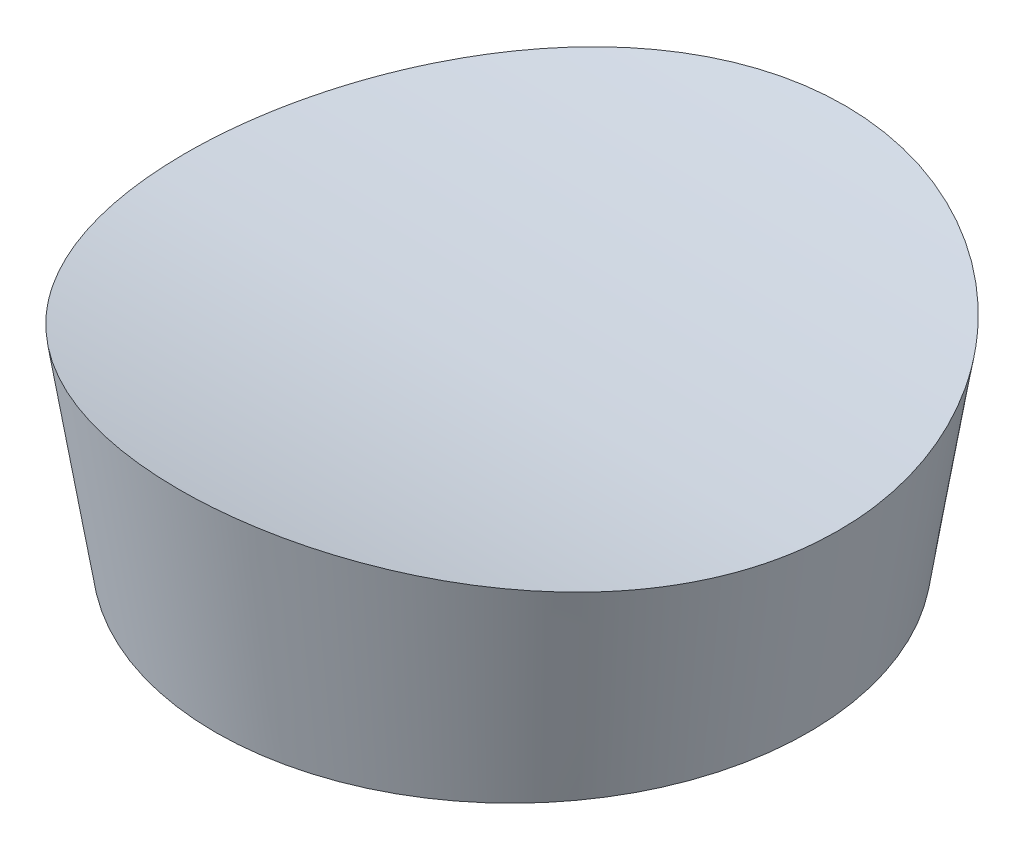
ISO-10303-21;
HEADER;
FILE_DESCRIPTION(('STEP AP214'),'2;1');
FILE_NAME('part.step','',(''),(''),'','','');
FILE_SCHEMA(('AUTOMOTIVE_DESIGN { 1 0 10303 214 1 1 1 1 }'));
ENDSEC;
DATA;
#1=APPLICATION_CONTEXT('core data for automotive mechanical design processes');
#2=APPLICATION_PROTOCOL_DEFINITION('international standard','automotive_design',2000,#1);
#3=PRODUCT_CONTEXT('',#1,'mechanical');
#4=PRODUCT('Part','Part','',(#3));
#5=PRODUCT_RELATED_PRODUCT_CATEGORY('part','',(#4));
#6=PRODUCT_DEFINITION_FORMATION('','',#4);
#7=PRODUCT_DEFINITION_CONTEXT('part definition',#1,'design');
#8=PRODUCT_DEFINITION('design','',#6,#7);
#9=PRODUCT_DEFINITION_SHAPE('','',#8);
#10=(LENGTH_UNIT() NAMED_UNIT(*) SI_UNIT(.MILLI.,.METRE.));
#11=(NAMED_UNIT(*) PLANE_ANGLE_UNIT() SI_UNIT($,.RADIAN.));
#12=(NAMED_UNIT(*) SI_UNIT($,.STERADIAN.) SOLID_ANGLE_UNIT());
#13=UNCERTAINTY_MEASURE_WITH_UNIT(LENGTH_MEASURE(1.E-05),#10,'distance_accuracy_value','');
#14=(GEOMETRIC_REPRESENTATION_CONTEXT(3) GLOBAL_UNCERTAINTY_ASSIGNED_CONTEXT((#13)) GLOBAL_UNIT_ASSIGNED_CONTEXT((#10,
#11,#12)) REPRESENTATION_CONTEXT('',''));
#15=CARTESIAN_POINT('',(0.,0.,0.));
#16=DIRECTION('',(0.,0.,1.));
#17=DIRECTION('',(1.,0.,0.));
#18=AXIS2_PLACEMENT_3D('',#15,#16,#17);
#19=CARTESIAN_POINT('',(0.,0.,0.));
#20=DIRECTION('',(0.,1.,0.));
#21=DIRECTION('',(0.,0.,1.));
#22=AXIS2_PLACEMENT_3D('',#19,#20,#21);
#23=CONICAL_SURFACE('',#22,12.5,0.15707963267949);
#24=CARTESIAN_POINT('',(-9.79078337046588,8.79502383712155,-9.85676767831937));
#25=CARTESIAN_POINT('',(-9.52201001819174,8.84000308906574,-10.1337812550792));
#26=CARTESIAN_POINT('',(-9.24169352011466,8.88511510549074,-10.3996177746062));
#27=CARTESIAN_POINT('',(-8.65972635622482,8.97436180227621,-10.907039986527));
#28=CARTESIAN_POINT('',(-8.3580735055314,9.01849638193599,-11.1486231891919));
#29=CARTESIAN_POINT('',(-7.73519448959338,9.10456852273854,-11.6058612476302));
#30=CARTESIAN_POINT('',(-7.41395945520545,9.14650507211751,-11.8215042211224));
#31=CARTESIAN_POINT('',(-6.75412273054465,9.22695327958736,-12.2250641410795));
#32=CARTESIAN_POINT('',(-6.41552170917071,9.26546506943634,-12.4129821543685));
#33=CARTESIAN_POINT('',(-5.72269907197905,9.33798296377066,-12.7598260844966));
#34=CARTESIAN_POINT('',(-5.36845587529564,9.37198256658853,-12.9187102876919));
#35=CARTESIAN_POINT('',(-4.64725424324481,9.43438025260953,-13.2057912626679));
#36=CARTESIAN_POINT('',(-4.28029568267938,9.46277828064,-13.3339877321928));
#37=CARTESIAN_POINT('',(-3.53642337251856,9.51308193606856,-13.5584994951417));
#38=CARTESIAN_POINT('',(-3.15951245221208,9.53498938744063,-13.6548237461487));
#39=CARTESIAN_POINT('',(-2.3984662073939,9.57162559184314,-13.8147271836155));
#40=CARTESIAN_POINT('',(-2.01433111140591,9.58635457155616,-13.8783074040736));
#41=CARTESIAN_POINT('',(-1.25406444111421,9.6078132060178,-13.9706166010654));
#42=CARTESIAN_POINT('',(-0.878065853757423,9.61478193408103,-14.0003877608468));
#43=CARTESIAN_POINT('',(-0.124835070595773,9.62133217406634,-14.0283766801587));
#44=CARTESIAN_POINT('',(0.25239709901608,9.62091384183473,-14.0265951053638));
#45=CARTESIAN_POINT('',(1.00527855848199,9.61270320255809,-13.9914975087233));
#46=CARTESIAN_POINT('',(1.38092796928513,9.604911469619,-13.9581839420142));
#47=CARTESIAN_POINT('',(2.12791658022713,9.58219314944619,-13.8603368749841));
#48=CARTESIAN_POINT('',(2.49925579646456,9.56726658886982,-13.7958034913077));
#49=CARTESIAN_POINT('',(3.22849116738591,9.53105140825212,-13.6375093892739));
#50=CARTESIAN_POINT('',(3.5865088671789,9.50987892021778,-13.5442809403099));
#51=CARTESIAN_POINT('',(4.29337518531039,9.46169256101525,-13.3290580282542));
#52=CARTESIAN_POINT('',(4.64222394880616,9.43467878238552,-13.2070640208675));
#53=CARTESIAN_POINT('',(5.32850729935074,9.3755669216387,-12.9352955182087));
#54=CARTESIAN_POINT('',(5.66594092300462,9.34346841168205,-12.7855186850522));
#55=CARTESIAN_POINT('',(6.32724789847718,9.27506995087565,-12.4593559241456));
#56=CARTESIAN_POINT('',(6.65112092938163,9.23876990067202,-12.282969367125));
#57=CARTESIAN_POINT('',(7.29114227296972,9.1620049145864,-11.900225349113));
#58=CARTESIAN_POINT('',(7.60690304277053,9.12145933732281,-11.6932359801122));
#59=CARTESIAN_POINT('',(8.22018009198749,9.038089690668,-11.2542128733598));
#60=CARTESIAN_POINT('',(8.51769614383059,8.9952655928684,-11.0221788233164));
#61=CARTESIAN_POINT('',(9.0927451408426,8.90847989919897,-10.5346563872124));
#62=CARTESIAN_POINT('',(9.37027495820494,8.86451812674235,-10.2791643441934));
#63=CARTESIAN_POINT('',(9.90366473589326,8.77661823147174,-9.74647461154569));
#64=CARTESIAN_POINT('',(10.1595241419317,8.73268010929122,-9.46927636706282));
#65=CARTESIAN_POINT('',(10.6569723530773,8.64438328005405,-8.88450799336034));
#66=CARTESIAN_POINT('',(10.8977009555143,8.60006762775229,-8.57619906317438));
#67=CARTESIAN_POINT('',(11.3527185384733,8.51390130418646,-7.94032086312481));
#68=CARTESIAN_POINT('',(11.5670068865744,8.47205069189584,-7.61275113284149));
#69=CARTESIAN_POINT('',(11.9677549852418,8.39195548620564,-6.94056509541099));
#70=CARTESIAN_POINT('',(12.1542133767029,8.35371106895194,-6.59594795682925));
#71=CARTESIAN_POINT('',(12.4980395478996,8.28187240529768,-5.89202899354365));
#72=CARTESIAN_POINT('',(12.6554073706359,8.24827815202342,-5.5327271905471));
#73=CARTESIAN_POINT('',(12.9414655014693,8.18633096625276,-4.79805073014877));
#74=CARTESIAN_POINT('',(13.0698365355281,8.15803692206747,-4.42254670499585));
#75=CARTESIAN_POINT('',(13.2948295842841,8.10792264024611,-3.66171688796381));
#76=CARTESIAN_POINT('',(13.3914513046249,8.0861024626312,-3.27639100505927));
#77=CARTESIAN_POINT('',(13.5522156298209,8.04954915148627,-2.49871901716342));
#78=CARTESIAN_POINT('',(13.616360645481,8.03481549191517,-2.10637343549631));
#79=CARTESIAN_POINT('',(13.711690710575,8.01284762822463,-1.31749218419449));
#80=CARTESIAN_POINT('',(13.7428761674631,8.00561333139624,-0.920956566419247));
#81=CARTESIAN_POINT('',(13.7718761134996,7.99888730248299,-0.131258795026894));
#82=CARTESIAN_POINT('',(13.7700773504717,7.99930583894145,0.261888441937944));
#83=CARTESIAN_POINT('',(13.7340678867232,8.00765442685765,1.04661335069347));
#84=CARTESIAN_POINT('',(13.6998574221795,8.01558442358106,1.43819103390027));
#85=CARTESIAN_POINT('',(13.5992840763907,8.03873738472437,2.21697161694258));
#86=CARTESIAN_POINT('',(13.5329214619592,8.05396028862431,2.60417455305449));
#87=CARTESIAN_POINT('',(13.3685386966317,8.09128087913641,3.37146200488084));
#88=CARTESIAN_POINT('',(13.2705184770472,8.11337858066504,3.75154650514828));
#89=CARTESIAN_POINT('',(13.0438616428539,8.16377143486942,4.50085270778781));
#90=CARTESIAN_POINT('',(12.9153136960787,8.19204862058881,4.87010245327652));
#91=CARTESIAN_POINT('',(12.6283594283594,8.25407042555708,5.596332620273));
#92=CARTESIAN_POINT('',(12.4699531868339,8.2878150302634,5.95331307441225));
#93=CARTESIAN_POINT('',(12.124348058406,8.35986324465007,6.65261285652672));
#94=CARTESIAN_POINT('',(11.937146477822,8.39816728076997,6.99493080905319));
#95=CARTESIAN_POINT('',(11.5352007822763,8.47829752360789,7.6625639060922));
#96=CARTESIAN_POINT('',(11.3204563658985,8.52012376886963,7.98787886447692));
#97=CARTESIAN_POINT('',(10.8620170870498,8.60669320510772,8.62317994234966));
#98=CARTESIAN_POINT('',(10.6179997983516,8.65146585278485,8.93292945777589));
#99=CARTESIAN_POINT('',(10.1047436108082,8.7422089963474,9.53059358910411));
#100=CARTESIAN_POINT('',(9.83550446364156,8.78817950402311,9.81850798997834));
#101=CARTESIAN_POINT('',(9.27352119135179,8.88002088656805,10.3704593850761));
#102=CARTESIAN_POINT('',(8.98077578496549,8.92589175586608,10.6344950760651));
#103=CARTESIAN_POINT('',(8.3736846579178,9.01621196692813,11.1367186920817));
#104=CARTESIAN_POINT('',(8.05933907124194,9.06066131750728,11.374906777418));
#105=CARTESIAN_POINT('',(7.41154729389365,9.14677501233809,11.8232949206794));
#106=CARTESIAN_POINT('',(7.07812736298074,9.18844302211859,12.0335321926938));
#107=CARTESIAN_POINT('',(6.39404919097289,9.26780810659314,12.424689493649));
#108=CARTESIAN_POINT('',(6.04339089388618,9.30550516838795,12.6056094273562));
#109=CARTESIAN_POINT('',(5.32736091203368,9.3757585645685,12.9365459847099));
#110=CARTESIAN_POINT('',(4.96199208943121,9.40831589296167,13.0865685855118));
#111=CARTESIAN_POINT('',(4.21914604140472,9.46726665217941,13.3543907604894));
#112=CARTESIAN_POINT('',(3.8416692144728,9.49366028562393,13.4721913939237));
#113=CARTESIAN_POINT('',(3.08987426002425,9.53868576049831,13.6711690439968));
#114=CARTESIAN_POINT('',(2.71585104270121,9.55754165852464,13.7534103520705));
#115=CARTESIAN_POINT('',(1.96189357281574,9.58809906447212,13.8859196380732));
#116=CARTESIAN_POINT('',(1.58195944579042,9.59980072412434,13.936188294097));
#117=CARTESIAN_POINT('',(0.819107216580116,9.61568034871565,14.0042667019701));
#118=CARTESIAN_POINT('',(0.436189675419473,9.61985969547566,14.0220824153115));
#119=CARTESIAN_POINT('',(-0.329778089441593,9.62056628839568,14.0250998226082));
#120=CARTESIAN_POINT('',(-0.712828310695713,9.61709366883751,14.0103020888859));
#121=CARTESIAN_POINT('',(-1.46415565021364,9.60283511494294,13.9492140315099));
#122=CARTESIAN_POINT('',(-1.83251920806165,9.59228205059321,13.9039263387794));
#123=CARTESIAN_POINT('',(-2.56402198674423,9.56441380934136,13.7832991053991));
#124=CARTESIAN_POINT('',(-2.92716133657353,9.54709879970151,13.7079603080869));
#125=CARTESIAN_POINT('',(-3.64571906470481,9.50621067761885,13.5278879925601));
#126=CARTESIAN_POINT('',(-4.00113725655771,9.48263741423423,13.4231537653583));
#127=CARTESIAN_POINT('',(-4.70186778086833,9.42990729284498,13.185173526565));
#128=CARTESIAN_POINT('',(-5.04717994526432,9.40075034204522,13.0519270411248));
#129=CARTESIAN_POINT('',(-5.72846129708915,9.33738983200127,12.7566969574252));
#130=CARTESIAN_POINT('',(-6.06432097088511,9.30314395768023,12.5944698431606));
#131=CARTESIAN_POINT('',(-6.72135357256238,9.23075128336529,12.243356233348));
#132=CARTESIAN_POINT('',(-7.0425264806347,9.19260447811019,12.054469701844));
#133=CARTESIAN_POINT('',(-7.66827025926677,9.11343770588442,11.6514060881329));
#134=CARTESIAN_POINT('',(-7.97283891068819,9.07241735653395,11.437225637477));
#135=CARTESIAN_POINT('',(-8.56353907015723,8.98859087727785,10.9850907145409));
#136=CARTESIAN_POINT('',(-8.84966957752308,8.94578465065579,10.7471349537028));
#137=CARTESIAN_POINT('',(-9.41212651068366,8.85788508415837,10.2397566103386));
#138=CARTESIAN_POINT('',(-9.68768923450373,8.81276598848375,9.96949141640532));
#139=CARTESIAN_POINT('',(-10.2154784338825,8.7230324344263,9.40698234020205));
#140=CARTESIAN_POINT('',(-10.4677043785274,8.67841798754452,9.11473795817777));
#141=CARTESIAN_POINT('',(-10.9472884126766,8.59089088679922,8.51021135105405));
#142=CARTESIAN_POINT('',(-11.17464337552,8.54797844733518,8.19792661438904));
#143=CARTESIAN_POINT('',(-11.6030191973554,8.46500803360094,7.55543914368093));
#144=CARTESIAN_POINT('',(-11.8040404099271,8.42495002100802,7.2252366503014));
#145=CARTESIAN_POINT('',(-12.1828418227887,8.34786146671504,6.54118809398421));
#146=CARTESIAN_POINT('',(-12.359969407009,8.3109235076029,6.1869699025995));
#147=CARTESIAN_POINT('',(-12.6840767436474,8.24217792066026,5.46451198439291));
#148=CARTESIAN_POINT('',(-12.8310559713416,8.21037038212538,5.09627201365802));
#149=CARTESIAN_POINT('',(-13.09380712552,8.15277375741944,4.34838704774305));
#150=CARTESIAN_POINT('',(-13.2095810279538,8.12698429019254,3.9687427763864));
#151=CARTESIAN_POINT('',(-13.4090802792485,8.08214241840455,3.20073672600584));
#152=CARTESIAN_POINT('',(-13.4928060152649,8.06308993245805,2.81237505235189));
#153=CARTESIAN_POINT('',(-13.6271603111751,8.03235184630761,2.0321656274271));
#154=CARTESIAN_POINT('',(-13.6779909958304,8.02062127249772,1.64035445489936));
#155=CARTESIAN_POINT('',(-13.7469918350935,8.00466739778246,0.85371318093694));
#156=CARTESIAN_POINT('',(-13.7651620192393,8.0004440900876,0.458883082232862));
#157=CARTESIAN_POINT('',(-13.7687023807161,7.99962243519635,-0.330956477437893));
#158=CARTESIAN_POINT('',(-13.7540705009268,8.00302456621517,-0.725965948100327));
#159=CARTESIAN_POINT('',(-13.6921149988124,8.01735996364372,-1.51327026459855));
#160=CARTESIAN_POINT('',(-13.6447917642444,8.02829314072656,-1.90556514257681));
#161=CARTESIAN_POINT('',(-13.5184080587923,8.05725017835232,-2.68097513900951));
#162=CARTESIAN_POINT('',(-13.4396477787776,8.07520693936735,-3.0641417536741));
#163=CARTESIAN_POINT('',(-13.2509730455881,8.11772448614661,-3.82236012622798));
#164=CARTESIAN_POINT('',(-13.1410579105058,8.14228541646016,-4.1974117063046));
#165=CARTESIAN_POINT('',(-12.8909185490643,8.19733265244709,-4.93662928092679));
#166=CARTESIAN_POINT('',(-12.7507074814547,8.22781638503014,-5.30079992358161));
#167=CARTESIAN_POINT('',(-12.4409268358552,8.2938924222542,-6.01592162096273));
#168=CARTESIAN_POINT('',(-12.2713603305324,8.3294841921645,-6.36687405457766));
#169=CARTESIAN_POINT('',(-11.9338160007135,8.39870513455768,-6.99753470241824));
#170=CARTESIAN_POINT('',(-11.7700371781178,8.43171705366866,-7.2795690950806));
#171=CARTESIAN_POINT('',(-11.4233795658412,8.50003727216887,-7.83146654219916));
#172=CARTESIAN_POINT('',(-11.2404960023272,8.53534614467813,-8.1013265303168));
#173=CARTESIAN_POINT('',(-10.8565127167181,8.60757768216479,-8.6274805581474));
#174=CARTESIAN_POINT('',(-10.6554152461346,8.64450014738675,-8.88377626841961));
#175=CARTESIAN_POINT('',(-10.2358763182122,8.71925819090669,-9.38162037164529));
#176=CARTESIAN_POINT('',(-10.0174341157496,8.75709380838472,-9.62316813024258));
#177=CARTESIAN_POINT('',(-9.79078337046588,8.79502383712155,-9.85676767831937));
#178=B_SPLINE_CURVE_WITH_KNOTS('',3,(#24,#25,#26,#27,#28,#29,#30,#31,#32,#33,#34,#35,#36,#37,
#38,#39,#40,#41,#42,#43,#44,#45,#46,#47,#48,#49,#50,#51,#52,#53,#54,#55,#56,#57,#58,#59,#60,#61,
#62,#63,#64,#65,#66,#67,#68,#69,#70,#71,#72,#73,#74,#75,#76,#77,#78,#79,#80,#81,#82,#83,#84,#85,
#86,#87,#88,#89,#90,#91,#92,#93,#94,#95,#96,#97,#98,#99,#100,#101,#102,#103,#104,#105,#106,#107,
#108,#109,#110,#111,#112,#113,#114,#115,#116,#117,#118,#119,#120,#121,#122,#123,#124,#125,#126,
#127,#128,#129,#130,#131,#132,#133,#134,#135,#136,#137,#138,#139,#140,#141,#142,#143,#144,#145,
#146,#147,#148,#149,#150,#151,#152,#153,#154,#155,#156,#157,#158,#159,#160,#161,#162,#163,#164,
#165,#166,#167,#168,#169,#170,#171,#172,#173,#174,#175,#176,#177),.UNSPECIFIED.,.T.,.F.,(4,2,2,
2,2,2,2,2,2,2,2,2,2,2,2,2,2,2,2,2,2,2,2,2,2,2,2,2,2,2,2,2,2,2,2,2,2,2,2,2,2,2,2,2,2,2,2,2,2,2,2,
2,2,2,2,2,2,2,2,2,2,2,2,2,2,2,2,2,2,2,2,2,2,2,2,2,4),(0.,1.16547618661081,2.33107189333592,
3.49719950045721,4.66328222463699,5.8310273399859,6.99878395645543,8.16621209943156,
9.3336033748426,10.4639394829114,11.5942517440779,12.7244760043856,13.8546960419479,
14.9651003414961,16.0754870511655,17.1859672406891,18.2964736951197,19.4343698818109,
20.5722802590123,21.7103683316988,22.8484855057071,24.0280906395905,25.2077239828135,
26.3874149158336,27.5671041050627,28.759209916771,29.951326780505,31.1433551382561,
32.3353687596873,33.5134147691878,34.6914521945961,35.8694798442685,37.0475100499625,
38.2221596340079,39.3968060937061,40.5715625034911,41.7463317703683,42.9354923746894,
44.124664688102,45.3139018641662,46.5031316640798,47.6907619029231,48.8783959995516,
50.0658001295535,51.2531652203684,52.4020044346525,53.5508192828711,54.6994230765273,
55.8480067138774,56.960554100633,58.0730739693587,59.1856206732103,60.2981858680465,
61.420581608057,62.5429788618706,63.6655257567864,64.7881335237601,65.95261164905,
67.1171162598048,68.281767098668,69.4464022983154,70.6382437630092,71.8301059696174,
73.0218926886882,74.2136650100109,75.3980431129372,76.5824201447221,77.7668714545875,
78.9513087157354,80.1246965200083,81.2981100089981,82.4710148578567,83.643797011572,
84.626450791537,85.6093507039756,86.5921292806542,87.5749501000199),.UNSPECIFIED.);
#179=CARTESIAN_POINT('',(-9.79078337046588,8.79502383712155,-9.85676767831937));
#180=VERTEX_POINT('',#179);
#181=EDGE_CURVE('E41',#180,#180,#178,.T.);
#182=ORIENTED_EDGE('',*,*,#181,.T.);
#183=EDGE_LOOP('',(#182));
#184=FACE_BOUND('',#183,.T.);
#185=CARTESIAN_POINT('',(0.,0.,0.));
#186=DIRECTION('',(0.,1.,0.));
#187=DIRECTION('',(0.,0.,1.));
#188=AXIS2_PLACEMENT_3D('',#185,#186,#187);
#189=CIRCLE('',#188,12.5);
#190=CARTESIAN_POINT('',(0.,0.,12.5));
#191=VERTEX_POINT('',#190);
#192=EDGE_CURVE('E10',#191,#191,#189,.T.);
#193=ORIENTED_EDGE('',*,*,#192,.T.);
#194=EDGE_LOOP('',(#193));
#195=FACE_BOUND('',#194,.T.);
#196=ADVANCED_FACE('F40',(#184,#195),#23,.T.);
#197=CARTESIAN_POINT('',(0.,0.,0.));
#198=DIRECTION('',(0.,1.,0.));
#199=DIRECTION('',(0.,0.,1.));
#200=AXIS2_PLACEMENT_3D('',#197,#198,#199);
#201=PLANE('',#200);
#202=CARTESIAN_POINT('',(0.,0.,0.));
#203=DIRECTION('',(0.,-1.,0.));
#204=DIRECTION('',(0.,0.,-1.));
#205=AXIS2_PLACEMENT_3D('',#202,#203,#204);
#206=CIRCLE('',#205,9.2);
#207=CARTESIAN_POINT('',(0.,0.,-9.2));
#208=VERTEX_POINT('',#207);
#209=EDGE_CURVE('E52',#208,#208,#206,.T.);
#210=ORIENTED_EDGE('',*,*,#209,.F.);
#211=EDGE_LOOP('',(#210));
#212=FACE_BOUND('',#211,.T.);
#213=ORIENTED_EDGE('',*,*,#192,.F.);
#214=EDGE_LOOP('',(#213));
#215=FACE_BOUND('',#214,.T.);
#216=ADVANCED_FACE('F74',(#212,#215),#201,.F.);
#217=CARTESIAN_POINT('',(0.,2.,0.));
#218=DIRECTION('',(0.,-1.,0.));
#219=DIRECTION('',(0.,0.,-1.));
#220=AXIS2_PLACEMENT_3D('',#217,#218,#219);
#221=CYLINDRICAL_SURFACE('',#220,9.2);
#222=CARTESIAN_POINT('',(0.,2.,0.));
#223=DIRECTION('',(0.,-1.,0.));
#224=DIRECTION('',(0.,0.,-1.));
#225=AXIS2_PLACEMENT_3D('',#222,#223,#224);
#226=CIRCLE('',#225,9.2);
#227=CARTESIAN_POINT('',(0.,2.,-9.2));
#228=VERTEX_POINT('',#227);
#229=EDGE_CURVE('E47',#228,#228,#226,.T.);
#230=ORIENTED_EDGE('',*,*,#229,.F.);
#231=EDGE_LOOP('',(#230));
#232=FACE_BOUND('',#231,.T.);
#233=ORIENTED_EDGE('',*,*,#209,.T.);
#234=EDGE_LOOP('',(#233));
#235=FACE_BOUND('',#234,.T.);
#236=ADVANCED_FACE('F67',(#232,#235),#221,.F.);
#237=CARTESIAN_POINT('',(0.,2.,0.));
#238=DIRECTION('',(0.,-1.,0.));
#239=DIRECTION('',(0.,0.,-1.));
#240=AXIS2_PLACEMENT_3D('',#237,#238,#239);
#241=PLANE('',#240);
#242=ORIENTED_EDGE('',*,*,#229,.T.);
#243=EDGE_LOOP('',(#242));
#244=FACE_BOUND('',#243,.T.);
#245=ADVANCED_FACE('F61',(#244),#241,.T.);
#246=CARTESIAN_POINT('',(-14.0838444032454,69.5,0.));
#247=DIRECTION('',(1.,0.,0.));
#248=DIRECTION('',(0.,0.,-1.));
#249=AXIS2_PLACEMENT_3D('',#246,#247,#248);
#250=CYLINDRICAL_SURFACE('',#249,61.5);
#251=ORIENTED_EDGE('',*,*,#181,.F.);
#252=EDGE_LOOP('',(#251));
#253=FACE_BOUND('',#252,.T.);
#254=ADVANCED_FACE('F62',(#253),#250,.F.);
#255=CLOSED_SHELL('',(#196,#216,#236,#245,#254));
#256=MANIFOLD_SOLID_BREP('B2',#255);
#257=ADVANCED_BREP_SHAPE_REPRESENTATION('',(#18,#256),#14);
#258=SHAPE_DEFINITION_REPRESENTATION(#9,#257);
ENDSEC;
END-ISO-10303-21;
